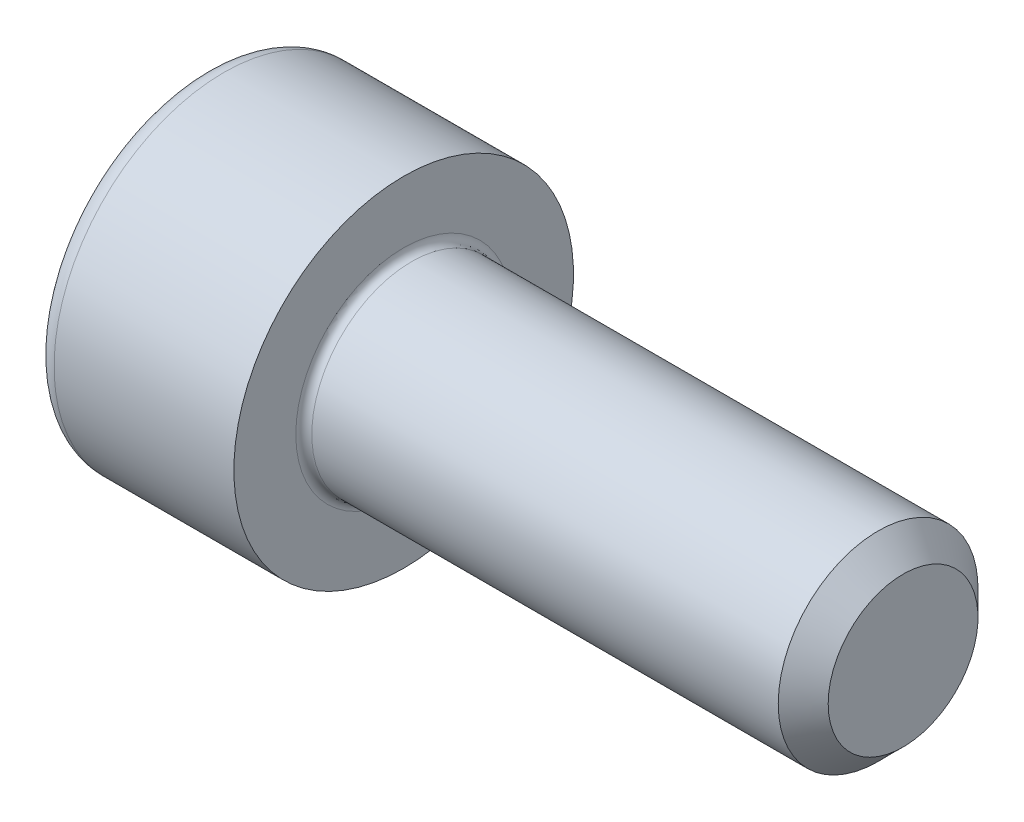
ISO-10303-21;
HEADER;
FILE_DESCRIPTION(('STEP AP214'),'2;1');
FILE_NAME('part.step','',(''),(''),'','','');
FILE_SCHEMA(('AUTOMOTIVE_DESIGN { 1 0 10303 214 1 1 1 1 }'));
ENDSEC;
DATA;
#1=APPLICATION_CONTEXT('core data for automotive mechanical design processes');
#2=APPLICATION_PROTOCOL_DEFINITION('international standard','automotive_design',2000,#1);
#3=PRODUCT_CONTEXT('',#1,'mechanical');
#4=PRODUCT('Part','Part','',(#3));
#5=PRODUCT_RELATED_PRODUCT_CATEGORY('part','',(#4));
#6=PRODUCT_DEFINITION_FORMATION('','',#4);
#7=PRODUCT_DEFINITION_CONTEXT('part definition',#1,'design');
#8=PRODUCT_DEFINITION('design','',#6,#7);
#9=PRODUCT_DEFINITION_SHAPE('','',#8);
#10=(LENGTH_UNIT() NAMED_UNIT(*) SI_UNIT(.MILLI.,.METRE.));
#11=(NAMED_UNIT(*) PLANE_ANGLE_UNIT() SI_UNIT($,.RADIAN.));
#12=(NAMED_UNIT(*) SI_UNIT($,.STERADIAN.) SOLID_ANGLE_UNIT());
#13=UNCERTAINTY_MEASURE_WITH_UNIT(LENGTH_MEASURE(1.E-05),#10,'distance_accuracy_value','');
#14=(GEOMETRIC_REPRESENTATION_CONTEXT(3) GLOBAL_UNCERTAINTY_ASSIGNED_CONTEXT((#13)) GLOBAL_UNIT_ASSIGNED_CONTEXT((#10,
#11,#12)) REPRESENTATION_CONTEXT('',''));
#15=CARTESIAN_POINT('',(0.,0.,0.));
#16=DIRECTION('',(0.,0.,1.));
#17=DIRECTION('',(1.,0.,0.));
#18=AXIS2_PLACEMENT_3D('',#15,#16,#17);
#19=CARTESIAN_POINT('',(-1.99999999995271,0.,0.));
#20=DIRECTION('',(-1.,0.,0.));
#21=DIRECTION('',(0.,0.,1.));
#22=AXIS2_PLACEMENT_3D('',#19,#20,#21);
#23=CONICAL_SURFACE('',#22,1.83319999985088,1.04719755109013);
#24=CARTESIAN_POINT('',(-0.941601486488253,-1.13686837721616E-10,0.));
#25=VERTEX_POINT('',#24);
#26=VERTEX_LOOP('',#25);
#27=FACE_BOUND('',#26,.T.);
#28=CARTESIAN_POINT('',(-2.00000000001834,0.,0.));
#29=DIRECTION('',(-1.,0.,0.));
#30=DIRECTION('',(0.,0.,1.));
#31=AXIS2_PLACEMENT_3D('',#28,#29,#30);
#32=CIRCLE('',#31,1.83319999996456);
#33=CARTESIAN_POINT('',(-2.00000000001834,-0.916599999982282,-1.58759777018694));
#34=VERTEX_POINT('',#33);
#35=CARTESIAN_POINT('',(-2.00000000001834,-1.83319999996456,0.));
#36=VERTEX_POINT('',#35);
#37=EDGE_CURVE('E89',#34,#36,#32,.T.);
#38=ORIENTED_EDGE('',*,*,#37,.T.);
#39=CARTESIAN_POINT('',(-2.00000000001834,0.,0.));
#40=DIRECTION('',(-1.,0.,0.));
#41=DIRECTION('',(0.,0.,1.));
#42=AXIS2_PLACEMENT_3D('',#39,#40,#41);
#43=CIRCLE('',#42,1.83319999996456);
#44=CARTESIAN_POINT('',(-2.00000000001834,-0.916599999982281,1.58759777018694));
#45=VERTEX_POINT('',#44);
#46=EDGE_CURVE('E84',#36,#45,#43,.T.);
#47=ORIENTED_EDGE('',*,*,#46,.T.);
#48=CARTESIAN_POINT('',(-2.00000000001834,0.,0.));
#49=DIRECTION('',(-1.,0.,0.));
#50=DIRECTION('',(0.,0.,1.));
#51=AXIS2_PLACEMENT_3D('',#48,#49,#50);
#52=CIRCLE('',#51,1.83319999996456);
#53=CARTESIAN_POINT('',(-1.99999999995271,0.916599999925436,1.58759777008849));
#54=VERTEX_POINT('',#53);
#55=EDGE_CURVE('E86',#45,#54,#52,.T.);
#56=ORIENTED_EDGE('',*,*,#55,.T.);
#57=CARTESIAN_POINT('',(-1.99999999995271,0.,0.));
#58=DIRECTION('',(-1.,0.,0.));
#59=DIRECTION('',(0.,0.,1.));
#60=AXIS2_PLACEMENT_3D('',#57,#58,#59);
#61=CIRCLE('',#60,1.83319999985088);
#62=CARTESIAN_POINT('',(-1.99999999995271,1.83319999985088,0.));
#63=VERTEX_POINT('',#62);
#64=EDGE_CURVE('E100',#54,#63,#61,.T.);
#65=ORIENTED_EDGE('',*,*,#64,.T.);
#66=CARTESIAN_POINT('',(-2.00000000001834,0.,0.));
#67=DIRECTION('',(-1.,0.,0.));
#68=DIRECTION('',(0.,0.,1.));
#69=AXIS2_PLACEMENT_3D('',#66,#67,#68);
#70=CIRCLE('',#69,1.83319999996456);
#71=CARTESIAN_POINT('',(-2.00000000001834,0.91659999998228,-1.58759777018694));
#72=VERTEX_POINT('',#71);
#73=EDGE_CURVE('E187',#63,#72,#70,.T.);
#74=ORIENTED_EDGE('',*,*,#73,.T.);
#75=CARTESIAN_POINT('',(-2.00000000001834,0.,0.));
#76=DIRECTION('',(-1.,0.,0.));
#77=DIRECTION('',(0.,0.,1.));
#78=AXIS2_PLACEMENT_3D('',#75,#76,#77);
#79=CIRCLE('',#78,1.83319999996456);
#80=EDGE_CURVE('E185',#72,#34,#79,.T.);
#81=ORIENTED_EDGE('',*,*,#80,.T.);
#82=EDGE_LOOP('',(#38,#47,#56,#65,#74,#81));
#83=FACE_BOUND('',#82,.T.);
#84=ADVANCED_FACE('F17',(#27,#83),#23,.F.);
#85=CARTESIAN_POINT('',(-2.,0.,0.));
#86=DIRECTION('',(-1.,0.,0.));
#87=DIRECTION('',(0.,-1.,0.));
#88=AXIS2_PLACEMENT_3D('',#85,#86,#87);
#89=PLANE('',#88);
#90=ORIENTED_EDGE('',*,*,#55,.F.);
#91=DIRECTION('',(0.,-1.,0.));
#92=VECTOR('',#91,1.);
#93=CARTESIAN_POINT('',(-2.,-0.9166,1.58759777021763));
#94=LINE('',#93,#92);
#95=EDGE_CURVE('E94',#45,#54,#94,.F.);
#96=ORIENTED_EDGE('',*,*,#95,.T.);
#97=EDGE_LOOP('',(#90,#96));
#98=FACE_BOUND('',#97,.T.);
#99=ADVANCED_FACE('F97',(#98),#89,.F.);
#100=CARTESIAN_POINT('',(-2.,0.,0.));
#101=DIRECTION('',(-1.,0.,0.));
#102=DIRECTION('',(0.,-1.,0.));
#103=AXIS2_PLACEMENT_3D('',#100,#101,#102);
#104=PLANE('',#103);
#105=ORIENTED_EDGE('',*,*,#64,.F.);
#106=DIRECTION('',(0.,-0.5,0.866025403784439));
#107=VECTOR('',#106,1.);
#108=CARTESIAN_POINT('',(-2.,0.9166,1.58759777021763));
#109=LINE('',#108,#107);
#110=EDGE_CURVE('E163',#54,#63,#109,.F.);
#111=ORIENTED_EDGE('',*,*,#110,.T.);
#112=EDGE_LOOP('',(#105,#111));
#113=FACE_BOUND('',#112,.T.);
#114=ADVANCED_FACE('F294',(#113),#104,.F.);
#115=CARTESIAN_POINT('',(-2.,0.,0.));
#116=DIRECTION('',(-1.,0.,0.));
#117=DIRECTION('',(0.,-1.,0.));
#118=AXIS2_PLACEMENT_3D('',#115,#116,#117);
#119=PLANE('',#118);
#120=ORIENTED_EDGE('',*,*,#73,.F.);
#121=DIRECTION('',(0.,0.5,0.866025403784439));
#122=VECTOR('',#121,1.);
#123=CARTESIAN_POINT('',(-2.,1.8332,0.));
#124=LINE('',#123,#122);
#125=EDGE_CURVE('E152',#63,#72,#124,.F.);
#126=ORIENTED_EDGE('',*,*,#125,.T.);
#127=EDGE_LOOP('',(#120,#126));
#128=FACE_BOUND('',#127,.T.);
#129=ADVANCED_FACE('F298',(#128),#119,.F.);
#130=CARTESIAN_POINT('',(-2.,0.,0.));
#131=DIRECTION('',(-1.,0.,0.));
#132=DIRECTION('',(0.,-1.,0.));
#133=AXIS2_PLACEMENT_3D('',#130,#131,#132);
#134=PLANE('',#133);
#135=ORIENTED_EDGE('',*,*,#80,.F.);
#136=DIRECTION('',(0.,1.,0.));
#137=VECTOR('',#136,1.);
#138=CARTESIAN_POINT('',(-2.,0.9166,-1.58759777021763));
#139=LINE('',#138,#137);
#140=EDGE_CURVE('E140',#72,#34,#139,.F.);
#141=ORIENTED_EDGE('',*,*,#140,.T.);
#142=EDGE_LOOP('',(#135,#141));
#143=FACE_BOUND('',#142,.T.);
#144=ADVANCED_FACE('F305',(#143),#134,.F.);
#145=CARTESIAN_POINT('',(-2.,0.,0.));
#146=DIRECTION('',(-1.,0.,0.));
#147=DIRECTION('',(0.,-1.,0.));
#148=AXIS2_PLACEMENT_3D('',#145,#146,#147);
#149=PLANE('',#148);
#150=ORIENTED_EDGE('',*,*,#37,.F.);
#151=DIRECTION('',(0.,0.5,-0.866025403784438));
#152=VECTOR('',#151,1.);
#153=CARTESIAN_POINT('',(-2.,-0.9166,-1.58759777021763));
#154=LINE('',#153,#152);
#155=EDGE_CURVE('E126',#34,#36,#154,.F.);
#156=ORIENTED_EDGE('',*,*,#155,.T.);
#157=EDGE_LOOP('',(#150,#156));
#158=FACE_BOUND('',#157,.T.);
#159=ADVANCED_FACE('F308',(#158),#149,.F.);
#160=CARTESIAN_POINT('',(-2.,0.,0.));
#161=DIRECTION('',(-1.,0.,0.));
#162=DIRECTION('',(0.,-1.,0.));
#163=AXIS2_PLACEMENT_3D('',#160,#161,#162);
#164=PLANE('',#163);
#165=ORIENTED_EDGE('',*,*,#46,.F.);
#166=DIRECTION('',(0.,-0.5,-0.866025403784438));
#167=VECTOR('',#166,1.);
#168=CARTESIAN_POINT('',(-2.,-1.8332,0.));
#169=LINE('',#168,#167);
#170=EDGE_CURVE('E102',#36,#45,#169,.F.);
#171=ORIENTED_EDGE('',*,*,#170,.T.);
#172=EDGE_LOOP('',(#165,#171));
#173=FACE_BOUND('',#172,.T.);
#174=ADVANCED_FACE('F103',(#173),#164,.F.);
#175=CARTESIAN_POINT('',(-2.,-0.9166,1.58759777021763));
#176=DIRECTION('',(0.,0.,1.));
#177=DIRECTION('',(0.,-1.,0.));
#178=AXIS2_PLACEMENT_3D('',#175,#176,#177);
#179=PLANE('',#178);
#180=DIRECTION('',(1.,0.,0.));
#181=VECTOR('',#180,1.);
#182=CARTESIAN_POINT('',(-2.,0.9166,1.58759777021763));
#183=LINE('',#182,#181);
#184=CARTESIAN_POINT('',(-4.,0.916599999999999,1.58759777021763));
#185=VERTEX_POINT('',#184);
#186=EDGE_CURVE('E114',#185,#54,#183,.T.);
#187=ORIENTED_EDGE('',*,*,#186,.T.);
#188=ORIENTED_EDGE('',*,*,#95,.F.);
#189=DIRECTION('',(1.,0.,0.));
#190=VECTOR('',#189,1.);
#191=CARTESIAN_POINT('',(-2.,-0.9166,1.58759777021763));
#192=LINE('',#191,#190);
#193=CARTESIAN_POINT('',(-4.,-0.9166,1.58759777021763));
#194=VERTEX_POINT('',#193);
#195=EDGE_CURVE('E107',#45,#194,#192,.F.);
#196=ORIENTED_EDGE('',*,*,#195,.T.);
#197=DIRECTION('',(0.,1.,0.));
#198=VECTOR('',#197,1.);
#199=CARTESIAN_POINT('',(-4.,1.8332,1.58759777021763));
#200=LINE('',#199,#198);
#201=EDGE_CURVE('E121',#194,#185,#200,.T.);
#202=ORIENTED_EDGE('',*,*,#201,.T.);
#203=EDGE_LOOP('',(#187,#188,#196,#202));
#204=FACE_BOUND('',#203,.T.);
#205=ADVANCED_FACE('F111',(#204),#179,.F.);
#206=CARTESIAN_POINT('',(-2.,0.9166,1.58759777021763));
#207=DIRECTION('',(0.,0.866025403784439,0.5));
#208=DIRECTION('',(0.,-0.5,0.866025403784439));
#209=AXIS2_PLACEMENT_3D('',#206,#207,#208);
#210=PLANE('',#209);
#211=DIRECTION('',(1.,0.,0.));
#212=VECTOR('',#211,1.);
#213=CARTESIAN_POINT('',(-2.,1.8332,0.));
#214=LINE('',#213,#212);
#215=CARTESIAN_POINT('',(-4.,1.8332,0.));
#216=VERTEX_POINT('',#215);
#217=EDGE_CURVE('E157',#216,#63,#214,.T.);
#218=ORIENTED_EDGE('',*,*,#217,.T.);
#219=ORIENTED_EDGE('',*,*,#110,.F.);
#220=ORIENTED_EDGE('',*,*,#186,.F.);
#221=DIRECTION('',(0.,0.500000000000001,-0.866025403784438));
#222=VECTOR('',#221,1.);
#223=CARTESIAN_POINT('',(-4.,0.9166,1.58759777021763));
#224=LINE('',#223,#222);
#225=EDGE_CURVE('E123',#185,#216,#224,.T.);
#226=ORIENTED_EDGE('',*,*,#225,.T.);
#227=EDGE_LOOP('',(#218,#219,#220,#226));
#228=FACE_BOUND('',#227,.T.);
#229=ADVANCED_FACE('F290',(#228),#210,.F.);
#230=CARTESIAN_POINT('',(-2.,1.8332,0.));
#231=DIRECTION('',(0.,0.866025403784439,-0.5));
#232=DIRECTION('',(0.,0.5,0.866025403784439));
#233=AXIS2_PLACEMENT_3D('',#230,#231,#232);
#234=PLANE('',#233);
#235=DIRECTION('',(1.,0.,0.));
#236=VECTOR('',#235,1.);
#237=CARTESIAN_POINT('',(-2.,0.9166,-1.58759777021763));
#238=LINE('',#237,#236);
#239=CARTESIAN_POINT('',(-4.,0.9166,-1.58759777021763));
#240=VERTEX_POINT('',#239);
#241=EDGE_CURVE('E145',#240,#72,#238,.T.);
#242=ORIENTED_EDGE('',*,*,#241,.T.);
#243=ORIENTED_EDGE('',*,*,#125,.F.);
#244=ORIENTED_EDGE('',*,*,#217,.F.);
#245=DIRECTION('',(0.,-0.499999999999999,-0.866025403784439));
#246=VECTOR('',#245,1.);
#247=CARTESIAN_POINT('',(-4.,1.8332,0.));
#248=LINE('',#247,#246);
#249=EDGE_CURVE('E147',#216,#240,#248,.T.);
#250=ORIENTED_EDGE('',*,*,#249,.T.);
#251=EDGE_LOOP('',(#242,#243,#244,#250));
#252=FACE_BOUND('',#251,.T.);
#253=ADVANCED_FACE('F301',(#252),#234,.F.);
#254=CARTESIAN_POINT('',(-2.,0.9166,-1.58759777021763));
#255=DIRECTION('',(0.,0.,-1.));
#256=DIRECTION('',(0.,1.,0.));
#257=AXIS2_PLACEMENT_3D('',#254,#255,#256);
#258=PLANE('',#257);
#259=DIRECTION('',(1.,0.,0.));
#260=VECTOR('',#259,1.);
#261=CARTESIAN_POINT('',(-2.,-0.9166,-1.58759777021763));
#262=LINE('',#261,#260);
#263=CARTESIAN_POINT('',(-4.,-0.9166,-1.58759777021763));
#264=VERTEX_POINT('',#263);
#265=EDGE_CURVE('E128',#264,#34,#262,.T.);
#266=ORIENTED_EDGE('',*,*,#265,.T.);
#267=ORIENTED_EDGE('',*,*,#140,.F.);
#268=ORIENTED_EDGE('',*,*,#241,.F.);
#269=DIRECTION('',(0.,1.,0.));
#270=VECTOR('',#269,1.);
#271=CARTESIAN_POINT('',(-4.,1.8332,-1.58759777021763));
#272=LINE('',#271,#270);
#273=EDGE_CURVE('E131',#240,#264,#272,.F.);
#274=ORIENTED_EDGE('',*,*,#273,.T.);
#275=EDGE_LOOP('',(#266,#267,#268,#274));
#276=FACE_BOUND('',#275,.T.);
#277=ADVANCED_FACE('F306',(#276),#258,.F.);
#278=CARTESIAN_POINT('',(-2.,-0.9166,-1.58759777021763));
#279=DIRECTION('',(0.,-0.866025403784438,-0.5));
#280=DIRECTION('',(0.,0.5,-0.866025403784438));
#281=AXIS2_PLACEMENT_3D('',#278,#279,#280);
#282=PLANE('',#281);
#283=DIRECTION('',(1.,0.,0.));
#284=VECTOR('',#283,1.);
#285=CARTESIAN_POINT('',(-2.,-1.8332,0.));
#286=LINE('',#285,#284);
#287=CARTESIAN_POINT('',(-4.,-1.8332,0.));
#288=VERTEX_POINT('',#287);
#289=EDGE_CURVE('E108',#288,#36,#286,.T.);
#290=ORIENTED_EDGE('',*,*,#289,.T.);
#291=ORIENTED_EDGE('',*,*,#155,.F.);
#292=ORIENTED_EDGE('',*,*,#265,.F.);
#293=DIRECTION('',(0.,-0.5,0.866025403784439));
#294=VECTOR('',#293,1.);
#295=CARTESIAN_POINT('',(-4.,-0.9166,-1.58759777021763));
#296=LINE('',#295,#294);
#297=EDGE_CURVE('E129',#264,#288,#296,.T.);
#298=ORIENTED_EDGE('',*,*,#297,.T.);
#299=EDGE_LOOP('',(#290,#291,#292,#298));
#300=FACE_BOUND('',#299,.T.);
#301=ADVANCED_FACE('F281',(#300),#282,.F.);
#302=CARTESIAN_POINT('',(-2.,-1.8332,0.));
#303=DIRECTION('',(0.,-0.866025403784438,0.5));
#304=DIRECTION('',(0.,-0.5,-0.866025403784438));
#305=AXIS2_PLACEMENT_3D('',#302,#303,#304);
#306=PLANE('',#305);
#307=ORIENTED_EDGE('',*,*,#195,.F.);
#308=ORIENTED_EDGE('',*,*,#170,.F.);
#309=ORIENTED_EDGE('',*,*,#289,.F.);
#310=DIRECTION('',(0.,0.5,0.866025403784439));
#311=VECTOR('',#310,1.);
#312=CARTESIAN_POINT('',(-4.,-1.8332,0.));
#313=LINE('',#312,#311);
#314=EDGE_CURVE('E119',#288,#194,#313,.T.);
#315=ORIENTED_EDGE('',*,*,#314,.T.);
#316=EDGE_LOOP('',(#307,#308,#309,#315));
#317=FACE_BOUND('',#316,.T.);
#318=ADVANCED_FACE('F117',(#317),#306,.F.);
#319=CARTESIAN_POINT('',(-4.,1.8332,0.));
#320=DIRECTION('',(1.,0.,0.));
#321=DIRECTION('',(0.,1.,0.));
#322=AXIS2_PLACEMENT_3D('',#319,#320,#321);
#323=PLANE('',#322);
#324=CARTESIAN_POINT('',(-4.,0.,0.));
#325=DIRECTION('',(1.,0.,0.));
#326=DIRECTION('',(0.,-1.,0.));
#327=AXIS2_PLACEMENT_3D('',#324,#325,#326);
#328=CIRCLE('',#327,3.);
#329=CARTESIAN_POINT('',(-4.,-3.,0.));
#330=VERTEX_POINT('',#329);
#331=CARTESIAN_POINT('',(-4.,3.,0.));
#332=VERTEX_POINT('',#331);
#333=EDGE_CURVE('E135',#330,#332,#328,.T.);
#334=ORIENTED_EDGE('',*,*,#333,.F.);
#335=CARTESIAN_POINT('',(-4.,0.,0.));
#336=DIRECTION('',(1.,0.,0.));
#337=DIRECTION('',(0.,1.,0.));
#338=AXIS2_PLACEMENT_3D('',#335,#336,#337);
#339=CIRCLE('',#338,3.);
#340=EDGE_CURVE('E250',#332,#330,#339,.T.);
#341=ORIENTED_EDGE('',*,*,#340,.F.);
#342=EDGE_LOOP('',(#334,#341));
#343=FACE_BOUND('',#342,.T.);
#344=ORIENTED_EDGE('',*,*,#297,.F.);
#345=ORIENTED_EDGE('',*,*,#273,.F.);
#346=ORIENTED_EDGE('',*,*,#249,.F.);
#347=ORIENTED_EDGE('',*,*,#225,.F.);
#348=ORIENTED_EDGE('',*,*,#201,.F.);
#349=ORIENTED_EDGE('',*,*,#314,.F.);
#350=EDGE_LOOP('',(#344,#345,#346,#347,#348,#349));
#351=FACE_BOUND('',#350,.T.);
#352=ADVANCED_FACE('F259',(#343,#351),#323,.F.);
#353=CARTESIAN_POINT('',(-3.6,0.,0.));
#354=DIRECTION('',(-1.,0.,0.));
#355=DIRECTION('',(0.,1.,0.));
#356=AXIS2_PLACEMENT_3D('',#353,#354,#355);
#357=TOROIDAL_SURFACE('',#356,3.,0.4);
#358=ORIENTED_EDGE('',*,*,#333,.T.);
#359=ORIENTED_EDGE('',*,*,#340,.T.);
#360=EDGE_LOOP('',(#358,#359));
#361=FACE_BOUND('',#360,.T.);
#362=CARTESIAN_POINT('',(-3.6,0.,0.));
#363=DIRECTION('',(-1.,0.,0.));
#364=DIRECTION('',(0.,-1.,0.));
#365=AXIS2_PLACEMENT_3D('',#362,#363,#364);
#366=CIRCLE('',#365,3.4);
#367=CARTESIAN_POINT('',(-3.6,-3.4,0.));
#368=VERTEX_POINT('',#367);
#369=EDGE_CURVE('E182',#368,#368,#366,.F.);
#370=ORIENTED_EDGE('',*,*,#369,.F.);
#371=EDGE_LOOP('',(#370));
#372=FACE_BOUND('',#371,.T.);
#373=ADVANCED_FACE('F254',(#361,#372),#357,.T.);
#374=CARTESIAN_POINT('',(-0.94160148652158,0.,0.));
#375=DIRECTION('',(-1.,0.,0.));
#376=DIRECTION('',(0.,-1.,0.));
#377=AXIS2_PLACEMENT_3D('',#374,#375,#376);
#378=CYLINDRICAL_SURFACE('',#377,3.4);
#379=ORIENTED_EDGE('',*,*,#369,.T.);
#380=EDGE_LOOP('',(#379));
#381=FACE_BOUND('',#380,.T.);
#382=CARTESIAN_POINT('',(0.,0.,0.));
#383=DIRECTION('',(-1.,0.,0.));
#384=DIRECTION('',(0.,-1.,0.));
#385=AXIS2_PLACEMENT_3D('',#382,#383,#384);
#386=CIRCLE('',#385,3.4);
#387=CARTESIAN_POINT('',(0.,-3.4,0.));
#388=VERTEX_POINT('',#387);
#389=EDGE_CURVE('E180',#388,#388,#386,.T.);
#390=ORIENTED_EDGE('',*,*,#389,.T.);
#391=EDGE_LOOP('',(#390));
#392=FACE_BOUND('',#391,.T.);
#393=ADVANCED_FACE('F258',(#381,#392),#378,.T.);
#394=CARTESIAN_POINT('',(10.,0.,0.));
#395=DIRECTION('',(1.,0.,0.));
#396=DIRECTION('',(0.,1.,0.));
#397=AXIS2_PLACEMENT_3D('',#394,#395,#396);
#398=PLANE('',#397);
#399=CARTESIAN_POINT('',(9.99999999999091,0.,0.));
#400=DIRECTION('',(-1.,0.,0.));
#401=DIRECTION('',(0.,0.,1.));
#402=AXIS2_PLACEMENT_3D('',#399,#400,#401);
#403=CIRCLE('',#402,1.49999999996453);
#404=CARTESIAN_POINT('',(9.99999999999091,0.,1.49999999996453));
#405=VERTEX_POINT('',#404);
#406=EDGE_CURVE('E176',#405,#405,#403,.T.);
#407=ORIENTED_EDGE('',*,*,#406,.F.);
#408=EDGE_LOOP('',(#407));
#409=FACE_BOUND('',#408,.T.);
#410=ADVANCED_FACE('F227',(#409),#398,.T.);
#411=CARTESIAN_POINT('',(0.,3.4,0.));
#412=DIRECTION('',(-1.,0.,0.));
#413=DIRECTION('',(0.,-1.,0.));
#414=AXIS2_PLACEMENT_3D('',#411,#412,#413);
#415=PLANE('',#414);
#416=CARTESIAN_POINT('',(0.,0.,0.));
#417=DIRECTION('',(1.,0.,0.));
#418=DIRECTION('',(0.,-1.,0.));
#419=AXIS2_PLACEMENT_3D('',#416,#417,#418);
#420=CIRCLE('',#419,2.16);
#421=CARTESIAN_POINT('',(0.,2.16,0.));
#422=VERTEX_POINT('',#421);
#423=CARTESIAN_POINT('',(0.,-2.16,0.));
#424=VERTEX_POINT('',#423);
#425=EDGE_CURVE('E179',#422,#424,#420,.F.);
#426=ORIENTED_EDGE('',*,*,#425,.T.);
#427=CARTESIAN_POINT('',(0.,0.,0.));
#428=DIRECTION('',(1.,0.,0.));
#429=DIRECTION('',(0.,1.,0.));
#430=AXIS2_PLACEMENT_3D('',#427,#428,#429);
#431=CIRCLE('',#430,2.16);
#432=EDGE_CURVE('E36',#424,#422,#431,.F.);
#433=ORIENTED_EDGE('',*,*,#432,.T.);
#434=EDGE_LOOP('',(#426,#433));
#435=FACE_BOUND('',#434,.T.);
#436=ORIENTED_EDGE('',*,*,#389,.F.);
#437=EDGE_LOOP('',(#436));
#438=FACE_BOUND('',#437,.T.);
#439=ADVANCED_FACE('F218',(#435,#438),#415,.F.);
#440=CARTESIAN_POINT('',(9.50000000000273,0.,0.));
#441=DIRECTION('',(-1.,0.,0.));
#442=DIRECTION('',(0.,0.,1.));
#443=AXIS2_PLACEMENT_3D('',#440,#441,#442);
#444=CONICAL_SURFACE('',#443,1.99999999995271,0.785398163397448);
#445=ORIENTED_EDGE('',*,*,#406,.T.);
#446=EDGE_LOOP('',(#445));
#447=FACE_BOUND('',#446,.T.);
#448=CARTESIAN_POINT('',(9.5,0.,0.));
#449=DIRECTION('',(-1.,0.,0.));
#450=DIRECTION('',(0.,-1.,0.));
#451=AXIS2_PLACEMENT_3D('',#448,#449,#450);
#452=CIRCLE('',#451,2.);
#453=CARTESIAN_POINT('',(9.5,-2.,0.));
#454=VERTEX_POINT('',#453);
#455=EDGE_CURVE('E28',#454,#454,#452,.T.);
#456=ORIENTED_EDGE('',*,*,#455,.F.);
#457=EDGE_LOOP('',(#456));
#458=FACE_BOUND('',#457,.T.);
#459=ADVANCED_FACE('F207',(#447,#458),#444,.T.);
#460=CARTESIAN_POINT('',(0.16,0.,0.));
#461=DIRECTION('',(-1.,0.,0.));
#462=DIRECTION('',(0.,1.,0.));
#463=AXIS2_PLACEMENT_3D('',#460,#461,#462);
#464=TOROIDAL_SURFACE('',#463,2.16,0.16);
#465=CARTESIAN_POINT('',(0.16,0.,0.));
#466=DIRECTION('',(-1.,0.,0.));
#467=DIRECTION('',(0.,-1.,0.));
#468=AXIS2_PLACEMENT_3D('',#465,#466,#467);
#469=CIRCLE('',#468,2.);
#470=CARTESIAN_POINT('',(0.16,-2.,0.));
#471=VERTEX_POINT('',#470);
#472=EDGE_CURVE('E10',#471,#471,#469,.F.);
#473=ORIENTED_EDGE('',*,*,#472,.F.);
#474=EDGE_LOOP('',(#473));
#475=FACE_BOUND('',#474,.T.);
#476=ORIENTED_EDGE('',*,*,#425,.F.);
#477=ORIENTED_EDGE('',*,*,#432,.F.);
#478=EDGE_LOOP('',(#476,#477));
#479=FACE_BOUND('',#478,.T.);
#480=ADVANCED_FACE('F195',(#475,#479),#464,.F.);
#481=CARTESIAN_POINT('',(-0.94160148652158,0.,0.));
#482=DIRECTION('',(-1.,0.,0.));
#483=DIRECTION('',(0.,-1.,0.));
#484=AXIS2_PLACEMENT_3D('',#481,#482,#483);
#485=CYLINDRICAL_SURFACE('',#484,2.);
#486=ORIENTED_EDGE('',*,*,#472,.T.);
#487=EDGE_LOOP('',(#486));
#488=FACE_BOUND('',#487,.T.);
#489=ORIENTED_EDGE('',*,*,#455,.T.);
#490=EDGE_LOOP('',(#489));
#491=FACE_BOUND('',#490,.T.);
#492=ADVANCED_FACE('F206',(#488,#491),#485,.T.);
#493=CLOSED_SHELL('',(#84,#99,#114,#129,#144,#159,#174,#205,#229,#253,#277,#301,#318,#352,#373,
#393,#410,#439,#459,#480,#492));
#494=MANIFOLD_SOLID_BREP('B1',#493);
#495=ADVANCED_BREP_SHAPE_REPRESENTATION('',(#18,#494),#14);
#496=SHAPE_DEFINITION_REPRESENTATION(#9,#495);
ENDSEC;
END-ISO-10303-21;
